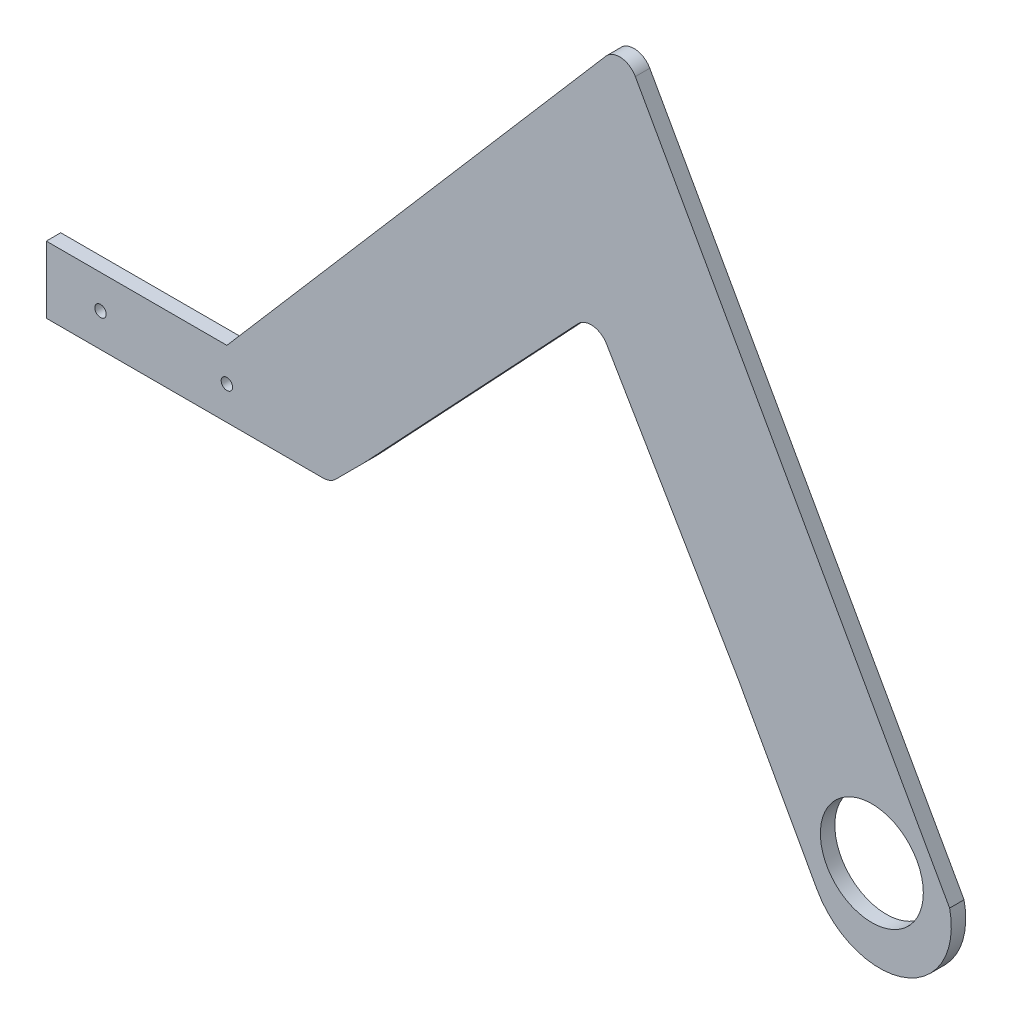
ISO-10303-21;
HEADER;
FILE_DESCRIPTION(('STEP AP214'),'2;1');
FILE_NAME('part.step','',(''),(''),'','','');
FILE_SCHEMA(('AUTOMOTIVE_DESIGN { 1 0 10303 214 1 1 1 1 }'));
ENDSEC;
DATA;
#1=APPLICATION_CONTEXT('core data for automotive mechanical design processes');
#2=APPLICATION_PROTOCOL_DEFINITION('international standard','automotive_design',2000,#1);
#3=PRODUCT_CONTEXT('',#1,'mechanical');
#4=PRODUCT('Part','Part','',(#3));
#5=PRODUCT_RELATED_PRODUCT_CATEGORY('part','',(#4));
#6=PRODUCT_DEFINITION_FORMATION('','',#4);
#7=PRODUCT_DEFINITION_CONTEXT('part definition',#1,'design');
#8=PRODUCT_DEFINITION('design','',#6,#7);
#9=PRODUCT_DEFINITION_SHAPE('','',#8);
#10=(LENGTH_UNIT() NAMED_UNIT(*) SI_UNIT(.MILLI.,.METRE.));
#11=(NAMED_UNIT(*) PLANE_ANGLE_UNIT() SI_UNIT($,.RADIAN.));
#12=(NAMED_UNIT(*) SI_UNIT($,.STERADIAN.) SOLID_ANGLE_UNIT());
#13=UNCERTAINTY_MEASURE_WITH_UNIT(LENGTH_MEASURE(1.E-05),#10,'distance_accuracy_value','');
#14=(GEOMETRIC_REPRESENTATION_CONTEXT(3) GLOBAL_UNCERTAINTY_ASSIGNED_CONTEXT((#13)) GLOBAL_UNIT_ASSIGNED_CONTEXT((#10,
#11,#12)) REPRESENTATION_CONTEXT('',''));
#15=CARTESIAN_POINT('',(0.,0.,0.));
#16=DIRECTION('',(0.,0.,1.));
#17=DIRECTION('',(1.,0.,0.));
#18=AXIS2_PLACEMENT_3D('',#15,#16,#17);
#19=CARTESIAN_POINT('',(141.635093823606,79.0657596551392,4.));
#20=DIRECTION('',(0.873161981754488,0.487430152553754,0.));
#21=DIRECTION('',(-0.487430152553754,0.873161981754488,0.));
#22=AXIS2_PLACEMENT_3D('',#19,#20,#21);
#23=PLANE('',#22);
#24=DIRECTION('',(0.487430152553754,-0.873161981754488,0.));
#25=VECTOR('',#24,1.);
#26=CARTESIAN_POINT('',(141.635093823606,79.0657596551392,0.));
#27=LINE('',#26,#25);
#28=CARTESIAN_POINT('',(113.076169938685,130.225021029276,0.));
#29=VERTEX_POINT('',#28);
#30=CARTESIAN_POINT('',(200.08,-25.63,0.));
#31=VERTEX_POINT('',#30);
#32=EDGE_CURVE('E191',#29,#31,#27,.T.);
#33=ORIENTED_EDGE('',*,*,#32,.F.);
#34=DIRECTION('',(0.,0.,-1.));
#35=VECTOR('',#34,1.);
#36=CARTESIAN_POINT('',(113.076169938685,130.225021029276,4.));
#37=LINE('',#36,#35);
#38=CARTESIAN_POINT('',(113.076169938685,130.225021029276,4.));
#39=VERTEX_POINT('',#38);
#40=EDGE_CURVE('E11',#39,#29,#37,.T.);
#41=ORIENTED_EDGE('',*,*,#40,.F.);
#42=DIRECTION('',(0.487430152553754,-0.873161981754488,0.));
#43=VECTOR('',#42,1.);
#44=CARTESIAN_POINT('',(141.635093823606,79.0657596551392,4.));
#45=LINE('',#44,#43);
#46=CARTESIAN_POINT('',(200.08,-25.63,4.));
#47=VERTEX_POINT('',#46);
#48=EDGE_CURVE('E493',#39,#47,#45,.T.);
#49=ORIENTED_EDGE('',*,*,#48,.T.);
#50=DIRECTION('',(0.,0.,-1.));
#51=VECTOR('',#50,1.);
#52=CARTESIAN_POINT('',(200.08,-25.63,4.));
#53=LINE('',#52,#51);
#54=EDGE_CURVE('E103',#47,#31,#53,.T.);
#55=ORIENTED_EDGE('',*,*,#54,.T.);
#56=EDGE_LOOP('',(#33,#41,#49,#55));
#57=FACE_BOUND('',#56,.T.);
#58=ADVANCED_FACE('F37',(#57),#23,.T.);
#59=CARTESIAN_POINT('',(108.710360029912,127.787870266507,4.));
#60=DIRECTION('',(0.,0.,-1.));
#61=DIRECTION('',(-1.,0.,0.));
#62=AXIS2_PLACEMENT_3D('',#59,#60,#61);
#63=CYLINDRICAL_SURFACE('',#62,4.99999999999999);
#64=CARTESIAN_POINT('',(108.710360029912,127.787870266507,0.));
#65=DIRECTION('',(0.,0.,1.));
#66=DIRECTION('',(1.,0.,0.));
#67=AXIS2_PLACEMENT_3D('',#64,#65,#66);
#68=CIRCLE('',#67,4.99999999999999);
#69=CARTESIAN_POINT('',(104.922096846911,131.051160332732,0.));
#70=VERTEX_POINT('',#69);
#71=EDGE_CURVE('E189',#29,#70,#68,.T.);
#72=ORIENTED_EDGE('',*,*,#71,.T.);
#73=DIRECTION('',(0.,0.,-1.));
#74=VECTOR('',#73,1.);
#75=CARTESIAN_POINT('',(104.922096846911,131.051160332732,4.));
#76=LINE('',#75,#74);
#77=CARTESIAN_POINT('',(104.922096846911,131.051160332732,4.));
#78=VERTEX_POINT('',#77);
#79=EDGE_CURVE('E46',#78,#70,#76,.T.);
#80=ORIENTED_EDGE('',*,*,#79,.F.);
#81=CARTESIAN_POINT('',(108.710360029912,127.787870266507,4.));
#82=DIRECTION('',(0.,0.,1.));
#83=DIRECTION('',(1.,0.,0.));
#84=AXIS2_PLACEMENT_3D('',#81,#82,#83);
#85=CIRCLE('',#84,4.99999999999999);
#86=EDGE_CURVE('E491',#39,#78,#85,.T.);
#87=ORIENTED_EDGE('',*,*,#86,.F.);
#88=ORIENTED_EDGE('',*,*,#40,.T.);
#89=EDGE_LOOP('',(#72,#80,#87,#88));
#90=FACE_BOUND('',#89,.T.);
#91=ADVANCED_FACE('F190',(#90),#63,.T.);
#92=CARTESIAN_POINT('',(-4.57401459693246,3.94015296083814,4.));
#93=DIRECTION('',(-0.757652636600195,0.652658013244894,0.));
#94=DIRECTION('',(-0.652658013244894,-0.757652636600195,0.));
#95=AXIS2_PLACEMENT_3D('',#92,#93,#94);
#96=PLANE('',#95);
#97=DIRECTION('',(0.652658013244894,0.757652636600195,0.));
#98=VECTOR('',#97,1.);
#99=CARTESIAN_POINT('',(-4.57401459693246,3.94015296083814,0.));
#100=LINE('',#99,#98);
#101=CARTESIAN_POINT('',(0.,9.25,0.));
#102=VERTEX_POINT('',#101);
#103=EDGE_CURVE('E184',#102,#70,#100,.T.);
#104=ORIENTED_EDGE('',*,*,#103,.F.);
#105=DIRECTION('',(0.,0.,-1.));
#106=VECTOR('',#105,1.);
#107=CARTESIAN_POINT('',(0.,9.25,4.));
#108=LINE('',#107,#106);
#109=CARTESIAN_POINT('',(0.,9.25,4.));
#110=VERTEX_POINT('',#109);
#111=EDGE_CURVE('E176',#110,#102,#108,.T.);
#112=ORIENTED_EDGE('',*,*,#111,.F.);
#113=DIRECTION('',(0.652658013244894,0.757652636600195,0.));
#114=VECTOR('',#113,1.);
#115=CARTESIAN_POINT('',(-4.57401459693246,3.94015296083814,4.));
#116=LINE('',#115,#114);
#117=EDGE_CURVE('E186',#110,#78,#116,.T.);
#118=ORIENTED_EDGE('',*,*,#117,.T.);
#119=ORIENTED_EDGE('',*,*,#79,.T.);
#120=EDGE_LOOP('',(#104,#112,#118,#119));
#121=FACE_BOUND('',#120,.T.);
#122=ADVANCED_FACE('F182',(#121),#96,.T.);
#123=CARTESIAN_POINT('',(0.,9.25,4.));
#124=DIRECTION('',(0.,-1.,0.));
#125=DIRECTION('',(0.,0.,-1.));
#126=AXIS2_PLACEMENT_3D('',#123,#124,#125);
#127=PLANE('',#126);
#128=DIRECTION('',(-1.,0.,0.));
#129=VECTOR('',#128,1.);
#130=CARTESIAN_POINT('',(0.,9.25,0.));
#131=LINE('',#130,#129);
#132=CARTESIAN_POINT('',(-50.,9.25,0.));
#133=VERTEX_POINT('',#132);
#134=EDGE_CURVE('E197',#102,#133,#131,.T.);
#135=ORIENTED_EDGE('',*,*,#134,.T.);
#136=DIRECTION('',(0.,0.,-1.));
#137=VECTOR('',#136,1.);
#138=CARTESIAN_POINT('',(-50.,9.25,4.));
#139=LINE('',#138,#137);
#140=CARTESIAN_POINT('',(-50.,9.25,4.));
#141=VERTEX_POINT('',#140);
#142=EDGE_CURVE('E174',#141,#133,#139,.T.);
#143=ORIENTED_EDGE('',*,*,#142,.F.);
#144=DIRECTION('',(-1.,0.,0.));
#145=VECTOR('',#144,1.);
#146=CARTESIAN_POINT('',(0.,9.25,4.));
#147=LINE('',#146,#145);
#148=EDGE_CURVE('E467',#110,#141,#147,.T.);
#149=ORIENTED_EDGE('',*,*,#148,.F.);
#150=ORIENTED_EDGE('',*,*,#111,.T.);
#151=EDGE_LOOP('',(#135,#143,#149,#150));
#152=FACE_BOUND('',#151,.T.);
#153=ADVANCED_FACE('F300',(#152),#127,.F.);
#154=CARTESIAN_POINT('',(-50.,0.,4.));
#155=DIRECTION('',(-1.,0.,0.));
#156=DIRECTION('',(0.,0.,1.));
#157=AXIS2_PLACEMENT_3D('',#154,#155,#156);
#158=PLANE('',#157);
#159=DIRECTION('',(0.,1.,0.));
#160=VECTOR('',#159,1.);
#161=CARTESIAN_POINT('',(-50.,0.,0.));
#162=LINE('',#161,#160);
#163=CARTESIAN_POINT('',(-50.,-9.25,0.));
#164=VERTEX_POINT('',#163);
#165=EDGE_CURVE('E199',#164,#133,#162,.T.);
#166=ORIENTED_EDGE('',*,*,#165,.F.);
#167=DIRECTION('',(0.,0.,-1.));
#168=VECTOR('',#167,1.);
#169=CARTESIAN_POINT('',(-50.,-9.25,4.));
#170=LINE('',#169,#168);
#171=CARTESIAN_POINT('',(-50.,-9.25,4.));
#172=VERTEX_POINT('',#171);
#173=EDGE_CURVE('E172',#172,#164,#170,.T.);
#174=ORIENTED_EDGE('',*,*,#173,.F.);
#175=DIRECTION('',(0.,1.,0.));
#176=VECTOR('',#175,1.);
#177=CARTESIAN_POINT('',(-50.,0.,4.));
#178=LINE('',#177,#176);
#179=EDGE_CURVE('E465',#172,#141,#178,.T.);
#180=ORIENTED_EDGE('',*,*,#179,.T.);
#181=ORIENTED_EDGE('',*,*,#142,.T.);
#182=EDGE_LOOP('',(#166,#174,#180,#181));
#183=FACE_BOUND('',#182,.T.);
#184=ADVANCED_FACE('F296',(#183),#158,.T.);
#185=CARTESIAN_POINT('',(0.,-9.25000000000002,4.));
#186=DIRECTION('',(0.,1.,0.));
#187=DIRECTION('',(-1.,0.,0.));
#188=AXIS2_PLACEMENT_3D('',#185,#186,#187);
#189=PLANE('',#188);
#190=DIRECTION('',(1.,0.,0.));
#191=VECTOR('',#190,1.);
#192=CARTESIAN_POINT('',(0.,-9.25000000000002,0.));
#193=LINE('',#192,#191);
#194=CARTESIAN_POINT('',(26.5889321881347,-9.25,0.));
#195=VERTEX_POINT('',#194);
#196=EDGE_CURVE('E204',#164,#195,#193,.T.);
#197=ORIENTED_EDGE('',*,*,#196,.T.);
#198=DIRECTION('',(0.,0.,-1.));
#199=VECTOR('',#198,1.);
#200=CARTESIAN_POINT('',(26.5889321881347,-9.25,4.));
#201=LINE('',#200,#199);
#202=CARTESIAN_POINT('',(26.5889321881347,-9.25,4.));
#203=VERTEX_POINT('',#202);
#204=EDGE_CURVE('E170',#203,#195,#201,.T.);
#205=ORIENTED_EDGE('',*,*,#204,.F.);
#206=DIRECTION('',(1.,0.,0.));
#207=VECTOR('',#206,1.);
#208=CARTESIAN_POINT('',(0.,-9.25000000000002,4.));
#209=LINE('',#208,#207);
#210=EDGE_CURVE('E466',#172,#203,#209,.T.);
#211=ORIENTED_EDGE('',*,*,#210,.F.);
#212=ORIENTED_EDGE('',*,*,#173,.T.);
#213=EDGE_LOOP('',(#197,#205,#211,#212));
#214=FACE_BOUND('',#213,.T.);
#215=ADVANCED_FACE('F292',(#214),#189,.F.);
#216=CARTESIAN_POINT('',(26.5889321881347,-4.25,4.));
#217=DIRECTION('',(0.,0.,-1.));
#218=DIRECTION('',(-1.,0.,0.));
#219=AXIS2_PLACEMENT_3D('',#216,#217,#218);
#220=CYLINDRICAL_SURFACE('',#219,5.);
#221=CARTESIAN_POINT('',(26.5889321881347,-4.25,0.));
#222=DIRECTION('',(0.,0.,1.));
#223=DIRECTION('',(1.,0.,0.));
#224=AXIS2_PLACEMENT_3D('',#221,#222,#223);
#225=CIRCLE('',#224,5.);
#226=CARTESIAN_POINT('',(30.1244660940674,-7.78553390593271,0.));
#227=VERTEX_POINT('',#226);
#228=EDGE_CURVE('E207',#227,#195,#225,.F.);
#229=ORIENTED_EDGE('',*,*,#228,.F.);
#230=DIRECTION('',(0.,0.,-1.));
#231=VECTOR('',#230,1.);
#232=CARTESIAN_POINT('',(30.1244660940674,-7.78553390593271,4.));
#233=LINE('',#232,#231);
#234=CARTESIAN_POINT('',(30.1244660940674,-7.78553390593271,4.));
#235=VERTEX_POINT('',#234);
#236=EDGE_CURVE('E168',#235,#227,#233,.T.);
#237=ORIENTED_EDGE('',*,*,#236,.F.);
#238=CARTESIAN_POINT('',(26.5889321881347,-4.25,4.));
#239=DIRECTION('',(0.,0.,1.));
#240=DIRECTION('',(1.,0.,0.));
#241=AXIS2_PLACEMENT_3D('',#238,#239,#240);
#242=CIRCLE('',#241,5.);
#243=EDGE_CURVE('E469',#235,#203,#242,.F.);
#244=ORIENTED_EDGE('',*,*,#243,.T.);
#245=ORIENTED_EDGE('',*,*,#204,.T.);
#246=EDGE_LOOP('',(#229,#237,#244,#245));
#247=FACE_BOUND('',#246,.T.);
#248=ADVANCED_FACE('F288',(#247),#220,.T.);
#249=CARTESIAN_POINT('',(18.9550000000003,-18.955,4.));
#250=DIRECTION('',(0.707106781186554,-0.707106781186542,0.));
#251=DIRECTION('',(0.707106781186542,0.707106781186554,0.));
#252=AXIS2_PLACEMENT_3D('',#249,#250,#251);
#253=PLANE('',#252);
#254=DIRECTION('',(-0.707106781186542,-0.707106781186554,0.));
#255=VECTOR('',#254,1.);
#256=CARTESIAN_POINT('',(18.9550000000003,-18.955,0.));
#257=LINE('',#256,#255);
#258=CARTESIAN_POINT('',(37.91,0.,0.));
#259=VERTEX_POINT('',#258);
#260=EDGE_CURVE('E210',#259,#227,#257,.T.);
#261=ORIENTED_EDGE('',*,*,#260,.F.);
#262=DIRECTION('',(0.,0.,-1.));
#263=VECTOR('',#262,1.);
#264=CARTESIAN_POINT('',(37.91,0.,4.));
#265=LINE('',#264,#263);
#266=CARTESIAN_POINT('',(37.91,0.,4.));
#267=VERTEX_POINT('',#266);
#268=EDGE_CURVE('E166',#267,#259,#265,.T.);
#269=ORIENTED_EDGE('',*,*,#268,.F.);
#270=DIRECTION('',(-0.707106781186542,-0.707106781186554,0.));
#271=VECTOR('',#270,1.);
#272=CARTESIAN_POINT('',(18.9550000000003,-18.955,4.));
#273=LINE('',#272,#271);
#274=EDGE_CURVE('E476',#267,#235,#273,.T.);
#275=ORIENTED_EDGE('',*,*,#274,.T.);
#276=ORIENTED_EDGE('',*,*,#236,.T.);
#277=EDGE_LOOP('',(#261,#269,#275,#276));
#278=FACE_BOUND('',#277,.T.);
#279=ADVANCED_FACE('F284',(#278),#253,.T.);
#280=CARTESIAN_POINT('',(20.1196075896796,-18.9191890460998,4.));
#281=DIRECTION('',(-0.728505543436866,0.685039906269522,0.));
#282=DIRECTION('',(-0.685039906269522,-0.728505543436866,0.));
#283=AXIS2_PLACEMENT_3D('',#280,#281,#282);
#284=PLANE('',#283);
#285=DIRECTION('',(0.685039906269522,0.728505543436866,0.));
#286=VECTOR('',#285,1.);
#287=CARTESIAN_POINT('',(20.1196075896796,-18.9191890460998,0.));
#288=LINE('',#287,#286);
#289=CARTESIAN_POINT('',(97.1654531920967,63.0151991646486,0.));
#290=VERTEX_POINT('',#289);
#291=EDGE_CURVE('E213',#259,#290,#288,.T.);
#292=ORIENTED_EDGE('',*,*,#291,.T.);
#293=DIRECTION('',(0.,0.,-1.));
#294=VECTOR('',#293,1.);
#295=CARTESIAN_POINT('',(97.1654531920967,63.0151991646486,4.));
#296=LINE('',#295,#294);
#297=CARTESIAN_POINT('',(97.1654531920967,63.0151991646486,4.));
#298=VERTEX_POINT('',#297);
#299=EDGE_CURVE('E160',#298,#290,#296,.T.);
#300=ORIENTED_EDGE('',*,*,#299,.F.);
#301=DIRECTION('',(0.685039906269522,0.728505543436866,0.));
#302=VECTOR('',#301,1.);
#303=CARTESIAN_POINT('',(20.1196075896796,-18.9191890460998,4.));
#304=LINE('',#303,#302);
#305=EDGE_CURVE('E479',#267,#298,#304,.T.);
#306=ORIENTED_EDGE('',*,*,#305,.F.);
#307=ORIENTED_EDGE('',*,*,#268,.T.);
#308=EDGE_LOOP('',(#292,#300,#306,#307));
#309=FACE_BOUND('',#308,.T.);
#310=ADVANCED_FACE('F280',(#309),#284,.F.);
#311=CARTESIAN_POINT('',(100.807980909281,59.589999633301,4.));
#312=DIRECTION('',(0.,0.,-1.));
#313=DIRECTION('',(-1.,0.,0.));
#314=AXIS2_PLACEMENT_3D('',#311,#312,#313);
#315=CYLINDRICAL_SURFACE('',#314,5.);
#316=CARTESIAN_POINT('',(100.807980909281,59.589999633301,0.));
#317=DIRECTION('',(0.,0.,1.));
#318=DIRECTION('',(1.,0.,0.));
#319=AXIS2_PLACEMENT_3D('',#316,#317,#318);
#320=CIRCLE('',#319,5.);
#321=CARTESIAN_POINT('',(105.120132172684,62.1208792198354,0.));
#322=VERTEX_POINT('',#321);
#323=EDGE_CURVE('E216',#322,#290,#320,.T.);
#324=ORIENTED_EDGE('',*,*,#323,.F.);
#325=DIRECTION('',(0.,0.,-1.));
#326=VECTOR('',#325,1.);
#327=CARTESIAN_POINT('',(105.120132172684,62.1208792198354,4.));
#328=LINE('',#327,#326);
#329=CARTESIAN_POINT('',(105.120132172684,62.1208792198354,4.));
#330=VERTEX_POINT('',#329);
#331=EDGE_CURVE('E158',#330,#322,#328,.T.);
#332=ORIENTED_EDGE('',*,*,#331,.F.);
#333=CARTESIAN_POINT('',(100.807980909281,59.589999633301,4.));
#334=DIRECTION('',(0.,0.,1.));
#335=DIRECTION('',(1.,0.,0.));
#336=AXIS2_PLACEMENT_3D('',#333,#334,#335);
#337=CIRCLE('',#336,5.);
#338=EDGE_CURVE('E152',#330,#298,#337,.T.);
#339=ORIENTED_EDGE('',*,*,#338,.T.);
#340=ORIENTED_EDGE('',*,*,#299,.T.);
#341=EDGE_LOOP('',(#324,#332,#339,#340));
#342=FACE_BOUND('',#341,.T.);
#343=ADVANCED_FACE('F277',(#342),#315,.F.);
#344=CARTESIAN_POINT('',(105.305213489763,61.805534847262,4.));
#345=DIRECTION('',(0.862430252680494,0.506175917306878,0.));
#346=DIRECTION('',(-0.506175917306878,0.862430252680494,0.));
#347=AXIS2_PLACEMENT_3D('',#344,#345,#346);
#348=PLANE('',#347);
#349=DIRECTION('',(0.506175917306878,-0.862430252680494,0.));
#350=VECTOR('',#349,1.);
#351=CARTESIAN_POINT('',(105.305213489763,61.805534847262,0.));
#352=LINE('',#351,#350);
#353=CARTESIAN_POINT('',(141.58,0.,0.));
#354=VERTEX_POINT('',#353);
#355=EDGE_CURVE('E157',#322,#354,#352,.T.);
#356=ORIENTED_EDGE('',*,*,#355,.T.);
#357=DIRECTION('',(0.,0.,-1.));
#358=VECTOR('',#357,1.);
#359=CARTESIAN_POINT('',(141.58,0.,4.));
#360=LINE('',#359,#358);
#361=CARTESIAN_POINT('',(141.58,0.,4.));
#362=VERTEX_POINT('',#361);
#363=EDGE_CURVE('E143',#362,#354,#360,.T.);
#364=ORIENTED_EDGE('',*,*,#363,.F.);
#365=DIRECTION('',(0.506175917306878,-0.862430252680494,0.));
#366=VECTOR('',#365,1.);
#367=CARTESIAN_POINT('',(105.305213489763,61.805534847262,4.));
#368=LINE('',#367,#366);
#369=EDGE_CURVE('E146',#330,#362,#368,.T.);
#370=ORIENTED_EDGE('',*,*,#369,.F.);
#371=ORIENTED_EDGE('',*,*,#331,.T.);
#372=EDGE_LOOP('',(#356,#364,#370,#371));
#373=FACE_BOUND('',#372,.T.);
#374=ADVANCED_FACE('F155',(#373),#348,.F.);
#375=CARTESIAN_POINT('',(108.57865915953,59.8601815811219,4.));
#376=DIRECTION('',(0.87573212831098,0.482797306790252,0.));
#377=DIRECTION('',(-0.482797306790252,0.87573212831098,0.));
#378=AXIS2_PLACEMENT_3D('',#375,#376,#377);
#379=PLANE('',#378);
#380=DIRECTION('',(0.482797306790252,-0.87573212831098,0.));
#381=VECTOR('',#380,1.);
#382=CARTESIAN_POINT('',(108.57865915953,59.8601815811219,0.));
#383=LINE('',#382,#381);
#384=CARTESIAN_POINT('',(163.352260056732,-39.4920753895282,0.));
#385=VERTEX_POINT('',#384);
#386=EDGE_CURVE('E220',#354,#385,#383,.T.);
#387=ORIENTED_EDGE('',*,*,#386,.T.);
#388=DIRECTION('',(0.,0.,-1.));
#389=VECTOR('',#388,1.);
#390=CARTESIAN_POINT('',(163.352260056732,-39.4920753895282,4.));
#391=LINE('',#390,#389);
#392=CARTESIAN_POINT('',(163.352260056732,-39.4920753895282,4.));
#393=VERTEX_POINT('',#392);
#394=EDGE_CURVE('E145',#393,#385,#391,.T.);
#395=ORIENTED_EDGE('',*,*,#394,.F.);
#396=DIRECTION('',(0.482797306790252,-0.87573212831098,0.));
#397=VECTOR('',#396,1.);
#398=CARTESIAN_POINT('',(108.57865915953,59.8601815811219,4.));
#399=LINE('',#398,#397);
#400=EDGE_CURVE('E138',#362,#393,#399,.T.);
#401=ORIENTED_EDGE('',*,*,#400,.F.);
#402=ORIENTED_EDGE('',*,*,#363,.T.);
#403=EDGE_LOOP('',(#387,#395,#401,#402));
#404=FACE_BOUND('',#403,.T.);
#405=ADVANCED_FACE('F141',(#404),#379,.F.);
#406=CARTESIAN_POINT('',(178.55,-25.63,4.));
#407=DIRECTION('',(0.,0.,-1.));
#408=DIRECTION('',(-1.,0.,0.));
#409=AXIS2_PLACEMENT_3D('',#406,#407,#408);
#410=CYLINDRICAL_SURFACE('',#409,14.25);
#411=CARTESIAN_POINT('',(178.55,-25.63,4.));
#412=DIRECTION('',(0.,0.,1.));
#413=DIRECTION('',(1.,0.,0.));
#414=AXIS2_PLACEMENT_3D('',#411,#412,#413);
#415=CIRCLE('',#414,14.25);
#416=CARTESIAN_POINT('',(192.8,-25.63,4.));
#417=VERTEX_POINT('',#416);
#418=EDGE_CURVE('E495',#417,#417,#415,.T.);
#419=ORIENTED_EDGE('',*,*,#418,.T.);
#420=EDGE_LOOP('',(#419));
#421=FACE_BOUND('',#420,.T.);
#422=CARTESIAN_POINT('',(178.55,-25.63,0.));
#423=DIRECTION('',(0.,0.,1.));
#424=DIRECTION('',(1.,0.,0.));
#425=AXIS2_PLACEMENT_3D('',#422,#423,#424);
#426=CIRCLE('',#425,14.25);
#427=CARTESIAN_POINT('',(192.8,-25.63,0.));
#428=VERTEX_POINT('',#427);
#429=EDGE_CURVE('E231',#428,#428,#426,.T.);
#430=ORIENTED_EDGE('',*,*,#429,.F.);
#431=EDGE_LOOP('',(#430));
#432=FACE_BOUND('',#431,.T.);
#433=ADVANCED_FACE('F241',(#421,#432),#410,.F.);
#434=CARTESIAN_POINT('',(0.,0.,4.));
#435=DIRECTION('',(0.,0.,-1.));
#436=DIRECTION('',(-1.,0.,0.));
#437=AXIS2_PLACEMENT_3D('',#434,#435,#436);
#438=CYLINDRICAL_SURFACE('',#437,1.58);
#439=CARTESIAN_POINT('',(0.,0.,4.));
#440=DIRECTION('',(0.,0.,1.));
#441=DIRECTION('',(1.,0.,0.));
#442=AXIS2_PLACEMENT_3D('',#439,#440,#441);
#443=CIRCLE('',#442,1.58);
#444=CARTESIAN_POINT('',(1.58,0.,4.));
#445=VERTEX_POINT('',#444);
#446=EDGE_CURVE('E255',#445,#445,#443,.T.);
#447=ORIENTED_EDGE('',*,*,#446,.T.);
#448=EDGE_LOOP('',(#447));
#449=FACE_BOUND('',#448,.T.);
#450=CARTESIAN_POINT('',(0.,0.,0.));
#451=DIRECTION('',(0.,0.,1.));
#452=DIRECTION('',(1.,0.,0.));
#453=AXIS2_PLACEMENT_3D('',#450,#451,#452);
#454=CIRCLE('',#453,1.58);
#455=CARTESIAN_POINT('',(1.58,0.,0.));
#456=VERTEX_POINT('',#455);
#457=EDGE_CURVE('E228',#456,#456,#454,.T.);
#458=ORIENTED_EDGE('',*,*,#457,.F.);
#459=EDGE_LOOP('',(#458));
#460=FACE_BOUND('',#459,.T.);
#461=ADVANCED_FACE('F243',(#449,#460),#438,.F.);
#462=CARTESIAN_POINT('',(-35.,0.,4.));
#463=DIRECTION('',(0.,0.,-1.));
#464=DIRECTION('',(-1.,0.,0.));
#465=AXIS2_PLACEMENT_3D('',#462,#463,#464);
#466=CYLINDRICAL_SURFACE('',#465,1.58);
#467=CARTESIAN_POINT('',(-35.,0.,4.));
#468=DIRECTION('',(0.,0.,1.));
#469=DIRECTION('',(1.,0.,0.));
#470=AXIS2_PLACEMENT_3D('',#467,#468,#469);
#471=CIRCLE('',#470,1.58);
#472=CARTESIAN_POINT('',(-33.42,0.,4.));
#473=VERTEX_POINT('',#472);
#474=EDGE_CURVE('E222',#473,#473,#471,.T.);
#475=ORIENTED_EDGE('',*,*,#474,.T.);
#476=EDGE_LOOP('',(#475));
#477=FACE_BOUND('',#476,.T.);
#478=CARTESIAN_POINT('',(-35.,0.,0.));
#479=DIRECTION('',(0.,0.,1.));
#480=DIRECTION('',(1.,0.,0.));
#481=AXIS2_PLACEMENT_3D('',#478,#479,#480);
#482=CIRCLE('',#481,1.58);
#483=CARTESIAN_POINT('',(-33.42,0.,0.));
#484=VERTEX_POINT('',#483);
#485=EDGE_CURVE('E225',#484,#484,#482,.T.);
#486=ORIENTED_EDGE('',*,*,#485,.F.);
#487=EDGE_LOOP('',(#486));
#488=FACE_BOUND('',#487,.T.);
#489=ADVANCED_FACE('F39',(#477,#488),#466,.F.);
#490=CARTESIAN_POINT('',(180.718543755687,-29.9179205449616,4.));
#491=DIRECTION('',(0.,0.,-1.));
#492=DIRECTION('',(-1.,0.,0.));
#493=AXIS2_PLACEMENT_3D('',#490,#491,#492);
#494=CYLINDRICAL_SURFACE('',#493,19.8305887582881);
#495=CARTESIAN_POINT('',(180.718543755687,-29.9179205449616,0.));
#496=DIRECTION('',(0.,0.,1.));
#497=DIRECTION('',(1.,0.,0.));
#498=AXIS2_PLACEMENT_3D('',#495,#496,#497);
#499=CIRCLE('',#498,19.8305887582881);
#500=EDGE_CURVE('E96',#385,#31,#499,.T.);
#501=ORIENTED_EDGE('',*,*,#500,.T.);
#502=ORIENTED_EDGE('',*,*,#54,.F.);
#503=CARTESIAN_POINT('',(180.718543755687,-29.9179205449616,4.));
#504=DIRECTION('',(0.,0.,1.));
#505=DIRECTION('',(1.,0.,0.));
#506=AXIS2_PLACEMENT_3D('',#503,#504,#505);
#507=CIRCLE('',#506,19.8305887582881);
#508=EDGE_CURVE('E54',#393,#47,#507,.T.);
#509=ORIENTED_EDGE('',*,*,#508,.F.);
#510=ORIENTED_EDGE('',*,*,#394,.T.);
#511=EDGE_LOOP('',(#501,#502,#509,#510));
#512=FACE_BOUND('',#511,.T.);
#513=ADVANCED_FACE('F250',(#512),#494,.T.);
#514=CARTESIAN_POINT('',(0.,0.,4.));
#515=DIRECTION('',(0.,0.,1.));
#516=DIRECTION('',(1.,0.,0.));
#517=AXIS2_PLACEMENT_3D('',#514,#515,#516);
#518=PLANE('',#517);
#519=ORIENTED_EDGE('',*,*,#474,.F.);
#520=EDGE_LOOP('',(#519));
#521=FACE_BOUND('',#520,.T.);
#522=ORIENTED_EDGE('',*,*,#446,.F.);
#523=EDGE_LOOP('',(#522));
#524=FACE_BOUND('',#523,.T.);
#525=ORIENTED_EDGE('',*,*,#418,.F.);
#526=EDGE_LOOP('',(#525));
#527=FACE_BOUND('',#526,.T.);
#528=ORIENTED_EDGE('',*,*,#48,.F.);
#529=ORIENTED_EDGE('',*,*,#86,.T.);
#530=ORIENTED_EDGE('',*,*,#117,.F.);
#531=ORIENTED_EDGE('',*,*,#148,.T.);
#532=ORIENTED_EDGE('',*,*,#179,.F.);
#533=ORIENTED_EDGE('',*,*,#210,.T.);
#534=ORIENTED_EDGE('',*,*,#243,.F.);
#535=ORIENTED_EDGE('',*,*,#274,.F.);
#536=ORIENTED_EDGE('',*,*,#305,.T.);
#537=ORIENTED_EDGE('',*,*,#338,.F.);
#538=ORIENTED_EDGE('',*,*,#369,.T.);
#539=ORIENTED_EDGE('',*,*,#400,.T.);
#540=ORIENTED_EDGE('',*,*,#508,.T.);
#541=EDGE_LOOP('',(#528,#529,#530,#531,#532,#533,#534,#535,#536,#537,#538,#539,#540));
#542=FACE_BOUND('',#541,.T.);
#543=ADVANCED_FACE('F150',(#521,#524,#527,#542),#518,.T.);
#544=CARTESIAN_POINT('',(0.,0.,0.));
#545=DIRECTION('',(0.,0.,1.));
#546=DIRECTION('',(1.,0.,0.));
#547=AXIS2_PLACEMENT_3D('',#544,#545,#546);
#548=PLANE('',#547);
#549=ORIENTED_EDGE('',*,*,#485,.T.);
#550=EDGE_LOOP('',(#549));
#551=FACE_BOUND('',#550,.T.);
#552=ORIENTED_EDGE('',*,*,#457,.T.);
#553=EDGE_LOOP('',(#552));
#554=FACE_BOUND('',#553,.T.);
#555=ORIENTED_EDGE('',*,*,#429,.T.);
#556=EDGE_LOOP('',(#555));
#557=FACE_BOUND('',#556,.T.);
#558=ORIENTED_EDGE('',*,*,#32,.T.);
#559=ORIENTED_EDGE('',*,*,#500,.F.);
#560=ORIENTED_EDGE('',*,*,#386,.F.);
#561=ORIENTED_EDGE('',*,*,#355,.F.);
#562=ORIENTED_EDGE('',*,*,#323,.T.);
#563=ORIENTED_EDGE('',*,*,#291,.F.);
#564=ORIENTED_EDGE('',*,*,#260,.T.);
#565=ORIENTED_EDGE('',*,*,#228,.T.);
#566=ORIENTED_EDGE('',*,*,#196,.F.);
#567=ORIENTED_EDGE('',*,*,#165,.T.);
#568=ORIENTED_EDGE('',*,*,#134,.F.);
#569=ORIENTED_EDGE('',*,*,#103,.T.);
#570=ORIENTED_EDGE('',*,*,#71,.F.);
#571=EDGE_LOOP('',(#558,#559,#560,#561,#562,#563,#564,#565,#566,#567,#568,#569,#570));
#572=FACE_BOUND('',#571,.T.);
#573=ADVANCED_FACE('F194',(#551,#554,#557,#572),#548,.F.);
#574=CLOSED_SHELL('',(#58,#91,#122,#153,#184,#215,#248,#279,#310,#343,#374,#405,#433,#461,#489,
#513,#543,#573));
#575=MANIFOLD_SOLID_BREP('B2',#574);
#576=ADVANCED_BREP_SHAPE_REPRESENTATION('',(#18,#575),#14);
#577=SHAPE_DEFINITION_REPRESENTATION(#9,#576);
ENDSEC;
END-ISO-10303-21;
